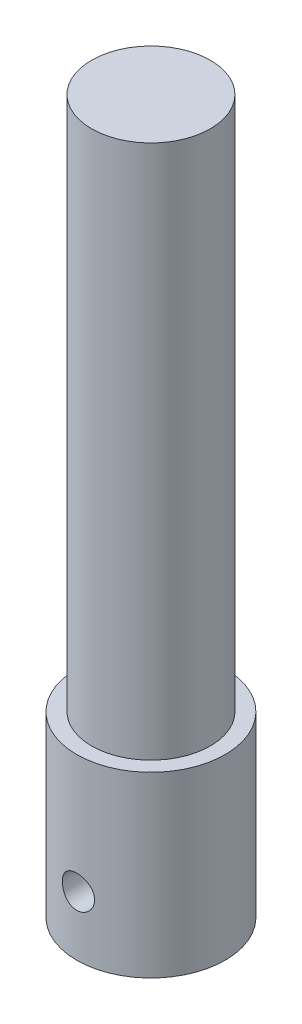
ISO-10303-21;
HEADER;
FILE_DESCRIPTION(('STEP AP214'),'2;1');
FILE_NAME('part.step','',(''),(''),'','','');
FILE_SCHEMA(('AUTOMOTIVE_DESIGN { 1 0 10303 214 1 1 1 1 }'));
ENDSEC;
DATA;
#1=APPLICATION_CONTEXT('core data for automotive mechanical design processes');
#2=APPLICATION_PROTOCOL_DEFINITION('international standard','automotive_design',2000,#1);
#3=PRODUCT_CONTEXT('',#1,'mechanical');
#4=PRODUCT('Part','Part','',(#3));
#5=PRODUCT_RELATED_PRODUCT_CATEGORY('part','',(#4));
#6=PRODUCT_DEFINITION_FORMATION('','',#4);
#7=PRODUCT_DEFINITION_CONTEXT('part definition',#1,'design');
#8=PRODUCT_DEFINITION('design','',#6,#7);
#9=PRODUCT_DEFINITION_SHAPE('','',#8);
#10=(LENGTH_UNIT() NAMED_UNIT(*) SI_UNIT(.MILLI.,.METRE.));
#11=(NAMED_UNIT(*) PLANE_ANGLE_UNIT() SI_UNIT($,.RADIAN.));
#12=(NAMED_UNIT(*) SI_UNIT($,.STERADIAN.) SOLID_ANGLE_UNIT());
#13=UNCERTAINTY_MEASURE_WITH_UNIT(LENGTH_MEASURE(1.E-05),#10,'distance_accuracy_value','');
#14=(GEOMETRIC_REPRESENTATION_CONTEXT(3) GLOBAL_UNCERTAINTY_ASSIGNED_CONTEXT((#13)) GLOBAL_UNIT_ASSIGNED_CONTEXT((#10,
#11,#12)) REPRESENTATION_CONTEXT('',''));
#15=CARTESIAN_POINT('',(0.,0.,0.));
#16=DIRECTION('',(0.,0.,1.));
#17=DIRECTION('',(1.,0.,0.));
#18=AXIS2_PLACEMENT_3D('',#15,#16,#17);
#19=CARTESIAN_POINT('',(0.,76.2,0.));
#20=DIRECTION('',(0.,-1.,0.));
#21=DIRECTION('',(0.,0.,-1.));
#22=AXIS2_PLACEMENT_3D('',#19,#20,#21);
#23=CYLINDRICAL_SURFACE('',#22,7.9375);
#24=CARTESIAN_POINT('',(0.,0.,0.));
#25=DIRECTION('',(0.,1.,0.));
#26=DIRECTION('',(0.,0.,1.));
#27=AXIS2_PLACEMENT_3D('',#24,#25,#26);
#28=CIRCLE('',#27,7.9375);
#29=CARTESIAN_POINT('',(0.,0.,7.9375));
#30=VERTEX_POINT('',#29);
#31=EDGE_CURVE('E62',#30,#30,#28,.T.);
#32=ORIENTED_EDGE('',*,*,#31,.T.);
#33=EDGE_LOOP('',(#32));
#34=FACE_BOUND('',#33,.T.);
#35=CARTESIAN_POINT('',(1.72719999999999,6.35,7.7473018793642));
#36=CARTESIAN_POINT('',(1.72719668934658,6.25422288416648,7.74730381496256));
#37=CARTESIAN_POINT('',(1.71920632372826,6.15840585932472,7.74909730894188));
#38=CARTESIAN_POINT('',(1.68749044022202,5.96949577976598,7.75606448138887));
#39=CARTESIAN_POINT('',(1.66375347043684,5.87640475905212,7.76124061988249));
#40=CARTESIAN_POINT('',(1.60132643913847,5.69570670160267,7.77435972900402));
#41=CARTESIAN_POINT('',(1.56265268844324,5.60809380364676,7.7822996806445));
#42=CARTESIAN_POINT('',(1.47149645243334,5.44059812370354,7.80004815248563));
#43=CARTESIAN_POINT('',(1.41901428176313,5.36071516563528,7.80985663010786));
#44=CARTESIAN_POINT('',(1.3007955986685,5.20960983626217,7.83042021280774));
#45=CARTESIAN_POINT('',(1.23487188523277,5.13853553146913,7.84118732124447));
#46=CARTESIAN_POINT('',(1.09204558542811,5.00836156326581,7.86234986267427));
#47=CARTESIAN_POINT('',(1.01514215186849,4.94926282473741,7.87274526690934));
#48=CARTESIAN_POINT('',(0.851547461158121,4.84413258948296,7.8921237586244));
#49=CARTESIAN_POINT('',(0.764762720819407,4.79824339763196,7.90109103211215));
#50=CARTESIAN_POINT('',(0.584485850349367,4.7217553989361,7.91646735399278));
#51=CARTESIAN_POINT('',(0.490994466326205,4.69115489424581,7.92287668643523));
#52=CARTESIAN_POINT('',(0.301497545745398,4.64657829765895,7.93233014656776));
#53=CARTESIAN_POINT('',(0.2055535200886,4.63235164682827,7.93542494201542));
#54=CARTESIAN_POINT('',(0.0125939937887284,4.62014331000262,7.93807614197008));
#55=CARTESIAN_POINT('',(-0.0844213842408734,4.62215978387743,7.9376329472844));
#56=CARTESIAN_POINT('',(-0.275042770208705,4.6421936310245,7.93329685945403));
#57=CARTESIAN_POINT('',(-0.368678680066907,4.65994094421362,7.92946219205056));
#58=CARTESIAN_POINT('',(-0.551610549776873,4.71050246465257,7.91884032698867));
#59=CARTESIAN_POINT('',(-0.640906314528686,4.74331734853447,7.91205299673719));
#60=CARTESIAN_POINT('',(-0.813374094986065,4.82332210117314,7.89619466058037));
#61=CARTESIAN_POINT('',(-0.896496972790562,4.8706145519973,7.88710744090932));
#62=CARTESIAN_POINT('',(-1.05372538980822,4.97815552091432,7.86764605576621));
#63=CARTESIAN_POINT('',(-1.12782971028207,5.0384057870478,7.85727171673861));
#64=CARTESIAN_POINT('',(-1.26652341474835,5.17162307560381,7.83612500001915));
#65=CARTESIAN_POINT('',(-1.33088539251444,5.24482645600858,7.82534882507236));
#66=CARTESIAN_POINT('',(-1.44646167392768,5.401098902571,7.80481330708035));
#67=CARTESIAN_POINT('',(-1.49767562855542,5.48416823053848,7.79505399103213));
#68=CARTESIAN_POINT('',(-1.58560173217603,5.65817964344237,7.77764730936367));
#69=CARTESIAN_POINT('',(-1.622271288776,5.749143913918,7.7700061660739));
#70=CARTESIAN_POINT('',(-1.67973550197491,5.93614897813458,7.75778750126867));
#71=CARTESIAN_POINT('',(-1.70053264822222,6.03218897320073,7.75320949930164));
#72=CARTESIAN_POINT('',(-1.72530975432462,6.22454240854874,7.74773333755294));
#73=CARTESIAN_POINT('',(-1.72962066551708,6.32081120717702,7.74676277197584));
#74=CARTESIAN_POINT('',(-1.72219860348343,6.51269195501178,7.74841611592597));
#75=CARTESIAN_POINT('',(-1.7104667202093,6.60830394839825,7.75103978126017));
#76=CARTESIAN_POINT('',(-1.67157912238781,6.79500713602921,7.75951762781856));
#77=CARTESIAN_POINT('',(-1.64460535153474,6.8861381176756,7.76533367824959));
#78=CARTESIAN_POINT('',(-1.57619651373566,7.06258711434735,7.77950663468477));
#79=CARTESIAN_POINT('',(-1.53476007433112,7.1479045767706,7.78786378182073));
#80=CARTESIAN_POINT('',(-1.43787173536774,7.31173787737346,7.80633659541367));
#81=CARTESIAN_POINT('',(-1.382215763733,7.39013016914734,7.81647713253223));
#82=CARTESIAN_POINT('',(-1.25873556642946,7.53658387451228,7.83730838639294));
#83=CARTESIAN_POINT('',(-1.19090984594748,7.60464401710499,7.84799917060691));
#84=CARTESIAN_POINT('',(-1.04351860870932,7.72978417303057,7.86896478339164));
#85=CARTESIAN_POINT('',(-0.963759740693738,7.78663866868895,7.87922831243881));
#86=CARTESIAN_POINT('',(-0.795631059762875,7.88614174220978,7.8979757812757));
#87=CARTESIAN_POINT('',(-0.707261646997062,7.92879097981278,7.906459803705));
#88=CARTESIAN_POINT('',(-0.524967980829005,7.99835790325755,7.92064465625516));
#89=CARTESIAN_POINT('',(-0.431082954098463,8.02537465147462,7.9263629737321));
#90=CARTESIAN_POINT('',(-0.239968524092139,8.06321934522901,7.9344476901939));
#91=CARTESIAN_POINT('',(-0.142739603787827,8.07404961867933,7.93681457117443));
#92=CARTESIAN_POINT('',(0.0501609432954705,8.07911016664185,7.93791560193408));
#93=CARTESIAN_POINT('',(0.145823467958653,8.07367729191246,7.93672346923526));
#94=CARTESIAN_POINT('',(0.334837197040776,8.04711862207229,7.93099817961568));
#95=CARTESIAN_POINT('',(0.428188442148943,8.025993103428,7.92646508155467));
#96=CARTESIAN_POINT('',(0.609672330433966,7.96880953945719,7.91457244917229));
#97=CARTESIAN_POINT('',(0.69782050928875,7.93279881721793,7.90722187750907));
#98=CARTESIAN_POINT('',(0.866868651522248,7.84691337558385,7.89047962727249));
#99=CARTESIAN_POINT('',(0.947767918166765,7.79703732539953,7.88108775279446));
#100=CARTESIAN_POINT('',(1.10166630982573,7.68373628494776,7.86106733244498));
#101=CARTESIAN_POINT('',(1.17448827291634,7.62007415348513,7.85041885288323));
#102=CARTESIAN_POINT('',(1.30853075097088,7.48148698201705,7.82919343609071));
#103=CARTESIAN_POINT('',(1.36974846889949,7.40655923438225,7.8186165166994));
#104=CARTESIAN_POINT('',(1.47962273760144,7.24637822799069,7.79857623674616));
#105=CARTESIAN_POINT('',(1.52810277350503,7.1610017038244,7.78912942210013));
#106=CARTESIAN_POINT('',(1.60994979803619,6.98312621324617,7.77262661741541));
#107=CARTESIAN_POINT('',(1.64332963527668,6.89063338075126,7.7655685960685));
#108=CARTESIAN_POINT('',(1.68803709150407,6.72336573508989,7.75595396623194));
#109=CARTESIAN_POINT('',(1.70269513711225,6.64950133007811,7.7527308775046));
#110=CARTESIAN_POINT('',(1.72227765922195,6.50043278112664,7.74840412449431));
#111=CARTESIAN_POINT('',(1.72720260037227,6.42522870131466,7.74730035903703));
#112=CARTESIAN_POINT('',(1.72719999999999,6.35,7.7473018793642));
#113=B_SPLINE_CURVE_WITH_KNOTS('',3,(#35,#36,#37,#38,#39,#40,#41,#42,#43,#44,#45,#46,#47,#48,
#49,#50,#51,#52,#53,#54,#55,#56,#57,#58,#59,#60,#61,#62,#63,#64,#65,#66,#67,#68,#69,#70,#71,#72,
#73,#74,#75,#76,#77,#78,#79,#80,#81,#82,#83,#84,#85,#86,#87,#88,#89,#90,#91,#92,#93,#94,#95,#96,
#97,#98,#99,#100,#101,#102,#103,#104,#105,#106,#107,#108,#109,#110,#111,#112),.UNSPECIFIED.,.T.,
.F.,(4,2,2,2,2,2,2,2,2,2,2,2,2,2,2,2,2,2,2,2,2,2,2,2,2,2,2,2,2,2,2,2,2,2,2,2,2,2,4),(0.,
0.28705565618224,0.574320306064567,0.86127214865707,1.14821745321058,1.43947171295688,
1.73074845791978,2.02505475487072,2.31932836113179,2.60903636539003,2.89871155004214,
3.18350800798754,3.46831725639996,3.75519318042258,4.04210782900355,4.33493181497964,
4.62776357327903,4.92144664994573,5.21508365182388,5.50279414401125,5.79048509003796,
6.07481227147667,6.35916644194667,6.64785640854874,6.93658185931359,7.23062929606426,
7.52466307434604,7.81681257042761,8.10892004598983,8.3950193890394,8.68111369182897,
8.96630535414906,9.25152439852483,9.54210676580753,9.83275908494857,10.1272488529481,
10.4214875689436,10.6469678939814,10.8724374545511),.UNSPECIFIED.);
#114=CARTESIAN_POINT('',(1.72719999999999,6.35,7.7473018793642));
#115=VERTEX_POINT('',#114);
#116=EDGE_CURVE('E49',#115,#115,#113,.T.);
#117=ORIENTED_EDGE('',*,*,#116,.T.);
#118=EDGE_LOOP('',(#117));
#119=FACE_BOUND('',#118,.T.);
#120=CARTESIAN_POINT('',(0.,8.0772,-7.9375));
#121=CARTESIAN_POINT('',(-0.0958073881689638,8.07719671111839,-7.93749823123906));
#122=CARTESIAN_POINT('',(-0.191654631127748,8.06920146534662,-7.93574773763832));
#123=CARTESIAN_POINT('',(-0.380627437848209,8.03746444271959,-7.92893373607812));
#124=CARTESIAN_POINT('',(-0.473750992784543,8.0137113350977,-7.9238678442009));
#125=CARTESIAN_POINT('',(-0.654517984196971,7.95123713123429,-7.91098719512658));
#126=CARTESIAN_POINT('',(-0.742167005950519,7.91253158954596,-7.90317529527452));
#127=CARTESIAN_POINT('',(-0.909723685589415,7.8213003937817,-7.88564613455322));
#128=CARTESIAN_POINT('',(-0.989631559862098,7.76877512615946,-7.8759289269658));
#129=CARTESIAN_POINT('',(-1.14071073132593,7.6505120795031,-7.8554813122122));
#130=CARTESIAN_POINT('',(-1.21174139937616,7.58459678742661,-7.84473844639552));
#131=CARTESIAN_POINT('',(-1.34183058450904,7.44180590413595,-7.82353826576888));
#132=CARTESIAN_POINT('',(-1.40088804281956,7.36492934465704,-7.81308097628268));
#133=CARTESIAN_POINT('',(-1.5059734850126,7.20136015333899,-7.7935131946505));
#134=CARTESIAN_POINT('',(-1.55185201420408,7.11456942312731,-7.78441867087501));
#135=CARTESIAN_POINT('',(-1.62831867237903,6.93427962880297,-7.76878483890528));
#136=CARTESIAN_POINT('',(-1.65890860943664,6.84078135944,-7.76224522857938));
#137=CARTESIAN_POINT('',(-1.70346549614082,6.65125527167878,-7.75258849074546));
#138=CARTESIAN_POINT('',(-1.71768129241551,6.55528861941545,-7.74942018588863));
#139=CARTESIAN_POINT('',(-1.72986006814801,6.36228419083473,-7.74671106045341));
#140=CARTESIAN_POINT('',(-1.7278250240853,6.26524654620843,-7.7471697987423));
#141=CARTESIAN_POINT('',(-1.70776020281197,6.0747028226476,-7.75161658533985));
#142=CARTESIAN_POINT('',(-1.69001926793959,5.98116461509589,-7.75554089613588));
#143=CARTESIAN_POINT('',(-1.6395037736733,5.79842478330104,-7.76637590985054));
#144=CARTESIAN_POINT('',(-1.60672837861298,5.70922340041822,-7.77328677877099));
#145=CARTESIAN_POINT('',(-1.52680845692337,5.53687604108789,-7.78937918391718));
#146=CARTESIAN_POINT('',(-1.47955265268967,5.45378336540575,-7.79857819698602));
#147=CARTESIAN_POINT('',(-1.37209159269284,5.29660014449477,-7.81819964287656));
#148=CARTESIAN_POINT('',(-1.31188458893718,5.22251081654074,-7.82862224075623));
#149=CARTESIAN_POINT('',(-1.17870011171346,5.08377422713114,-7.84979012929631));
#150=CARTESIAN_POINT('',(-1.10547696900433,5.01936289842318,-7.86053755301087));
#151=CARTESIAN_POINT('',(-0.949146705657905,4.90369617395151,-7.88094098483665));
#152=CARTESIAN_POINT('',(-0.866039409571111,4.85244101176847,-7.89059697356832));
#153=CARTESIAN_POINT('',(-0.692013590533541,4.76448418494795,-7.90776040439147));
#154=CARTESIAN_POINT('',(-0.601079090866837,4.72781318924851,-7.91526330965628));
#155=CARTESIAN_POINT('',(-0.414139308890587,4.67033718338767,-7.92724143566355));
#156=CARTESIAN_POINT('',(-0.318134758336938,4.64952989028775,-7.93171709204561));
#157=CARTESIAN_POINT('',(-0.12580408459721,4.62471452342532,-7.93707451121609));
#158=CARTESIAN_POINT('',(-0.0295214146921431,4.62038412610351,-7.93802521998525));
#159=CARTESIAN_POINT('',(0.162391579388402,4.62777218110166,-7.93641872364663));
#160=CARTESIAN_POINT('',(0.258021946898738,4.63948955666463,-7.93386175389344));
#161=CARTESIAN_POINT('',(0.444849540530789,4.67837323930876,-7.92557069335395));
#162=CARTESIAN_POINT('',(0.536083582859785,4.70537071603468,-7.91987134035831));
#163=CARTESIAN_POINT('',(0.712728334819346,4.77386102862357,-7.90593334051042));
#164=CARTESIAN_POINT('',(0.798138551128837,4.81535509063581,-7.89769447886854));
#165=CARTESIAN_POINT('',(0.962045634312511,4.91233389045406,-7.87942116984806));
#166=CARTESIAN_POINT('',(1.04042758538542,4.96800827572241,-7.86936296606736));
#167=CARTESIAN_POINT('',(1.18685200214202,5.09151733516522,-7.84861561400828));
#168=CARTESIAN_POINT('',(1.25489313766936,5.15935357129679,-7.83792638480515));
#169=CARTESIAN_POINT('',(1.37997692566292,5.30673906849459,-7.81688394304775));
#170=CARTESIAN_POINT('',(1.43679650032909,5.38647928852886,-7.8065404064753));
#171=CARTESIAN_POINT('',(1.53623833452736,5.55455987311723,-7.78758313020685));
#172=CARTESIAN_POINT('',(1.57886120614655,5.6428998666821,-7.7789693159407));
#173=CARTESIAN_POINT('',(1.64841342423577,5.82519991591713,-7.76452846939796));
#174=CARTESIAN_POINT('',(1.67543065695436,5.91912514637512,-7.75868586450804));
#175=CARTESIAN_POINT('',(1.71326275790443,6.11032560029862,-7.75042055627495));
#176=CARTESIAN_POINT('',(1.72408018644346,6.20760029191002,-7.74799731252034));
#177=CARTESIAN_POINT('',(1.72909752111868,6.40048977631736,-7.74687889875348));
#178=CARTESIAN_POINT('',(1.72365104863841,6.49609508094238,-7.74810439354014));
#179=CARTESIAN_POINT('',(1.69708510466239,6.68499070092299,-7.75396608736977));
#180=CARTESIAN_POINT('',(1.67596581393623,6.77828104296644,-7.75860224707428));
#181=CARTESIAN_POINT('',(1.61882377936269,6.9596211621887,-7.77072441574352));
#182=CARTESIAN_POINT('',(1.58285199436584,7.04768769200509,-7.77820067339822));
#183=CARTESIAN_POINT('',(1.49707004335149,7.21658837125174,-7.79516457788436));
#184=CARTESIAN_POINT('',(1.4472584527227,7.29742177500142,-7.80465243175721));
#185=CARTESIAN_POINT('',(1.33403578133058,7.45130595668544,-7.82480783773573));
#186=CARTESIAN_POINT('',(1.27037247419318,7.5241685957188,-7.83549519977694));
#187=CARTESIAN_POINT('',(1.13176529220538,7.65829258457816,-7.85671175612166));
#188=CARTESIAN_POINT('',(1.05681881453685,7.7195512502004,-7.86724091331228));
#189=CARTESIAN_POINT('',(0.896615921921774,7.82947904768777,-7.8871146306621));
#190=CARTESIAN_POINT('',(0.81123973085156,7.87797684814172,-7.89644228760264));
#191=CARTESIAN_POINT('',(0.63336299799249,7.95985717202353,-7.91269266690878));
#192=CARTESIAN_POINT('',(0.540868536319347,7.99325243132619,-7.91961741448108));
#193=CARTESIAN_POINT('',(0.373561939374604,8.03799563726985,-7.92903932251991));
#194=CARTESIAN_POINT('',(0.299658034136913,8.05266933824683,-7.93219249260771));
#195=CARTESIAN_POINT('',(0.150510913052046,8.07227259980638,-7.93642348104108));
#196=CARTESIAN_POINT('',(0.0752677555445903,8.07720258379591,-7.93750138956576));
#197=CARTESIAN_POINT('',(0.,8.0772,-7.9375));
#198=B_SPLINE_CURVE_WITH_KNOTS('',3,(#120,#121,#122,#123,#124,#125,#126,#127,#128,#129,#130,
#131,#132,#133,#134,#135,#136,#137,#138,#139,#140,#141,#142,#143,#144,#145,#146,#147,#148,#149,
#150,#151,#152,#153,#154,#155,#156,#157,#158,#159,#160,#161,#162,#163,#164,#165,#166,#167,#168,
#169,#170,#171,#172,#173,#174,#175,#176,#177,#178,#179,#180,#181,#182,#183,#184,#185,#186,#187,
#188,#189,#190,#191,#192,#193,#194,#195,#196,#197),.UNSPECIFIED.,.T.,.F.,(4,2,2,2,2,2,2,2,2,2,2,
2,2,2,2,2,2,2,2,2,2,2,2,2,2,2,2,2,2,2,2,2,2,2,2,2,2,2,4),(0.,0.287146664144717,
0.574500026604635,0.861555265748942,1.14860247855707,1.43973768043966,1.73089861573248,
2.02524168065781,2.31954992745942,2.60932381276328,2.89906245537193,3.18358079335431,
3.4681149477496,3.75489295700923,4.04170969632578,4.33466300802739,4.62762152059773,
4.92119287668269,5.21472197706305,5.50247858255765,5.79021588140075,6.07483434466125,
6.3594768873336,6.64814684314179,6.936853899677,7.23082329647932,7.52478001722772,
7.81706470306555,8.10930318972203,8.39523421285745,8.68116193812873,8.96611669259419,
9.25110078997556,9.54178852762672,9.83254342458674,10.1270230391282,10.4212538557239,
10.6468504884146,10.8724373177327),.UNSPECIFIED.);
#199=CARTESIAN_POINT('',(0.,8.0772,-7.9375));
#200=VERTEX_POINT('',#199);
#201=EDGE_CURVE('E12',#200,#200,#198,.T.);
#202=ORIENTED_EDGE('',*,*,#201,.T.);
#203=EDGE_LOOP('',(#202));
#204=FACE_BOUND('',#203,.T.);
#205=CARTESIAN_POINT('',(0.,19.05,0.));
#206=DIRECTION('',(0.,1.,0.));
#207=DIRECTION('',(0.,0.,1.));
#208=AXIS2_PLACEMENT_3D('',#205,#206,#207);
#209=CIRCLE('',#208,7.9375);
#210=CARTESIAN_POINT('',(0.,19.05,7.9375));
#211=VERTEX_POINT('',#210);
#212=EDGE_CURVE('E133',#211,#211,#209,.F.);
#213=ORIENTED_EDGE('',*,*,#212,.T.);
#214=EDGE_LOOP('',(#213));
#215=FACE_BOUND('',#214,.T.);
#216=ADVANCED_FACE('F39',(#34,#119,#204,#215),#23,.T.);
#217=CARTESIAN_POINT('',(0.,0.,0.));
#218=DIRECTION('',(0.,1.,0.));
#219=DIRECTION('',(0.,0.,1.));
#220=AXIS2_PLACEMENT_3D('',#217,#218,#219);
#221=PLANE('',#220);
#222=CARTESIAN_POINT('',(0.,0.,0.));
#223=DIRECTION('',(0.,-1.,0.));
#224=DIRECTION('',(0.,0.,-1.));
#225=AXIS2_PLACEMENT_3D('',#222,#223,#224);
#226=CIRCLE('',#225,5.);
#227=CARTESIAN_POINT('',(0.,0.,-5.));
#228=VERTEX_POINT('',#227);
#229=EDGE_CURVE('E102',#228,#228,#226,.T.);
#230=ORIENTED_EDGE('',*,*,#229,.F.);
#231=EDGE_LOOP('',(#230));
#232=FACE_BOUND('',#231,.T.);
#233=ORIENTED_EDGE('',*,*,#31,.F.);
#234=EDGE_LOOP('',(#233));
#235=FACE_BOUND('',#234,.T.);
#236=ADVANCED_FACE('F117',(#232,#235),#221,.F.);
#237=CARTESIAN_POINT('',(0.,13.9999974,0.));
#238=DIRECTION('',(0.,-1.,0.));
#239=DIRECTION('',(0.,0.,-1.));
#240=AXIS2_PLACEMENT_3D('',#237,#238,#239);
#241=CONICAL_SURFACE('',#240,4.99999999999999,1.02974425867665);
#242=CARTESIAN_POINT('',(0.,13.9999974,0.));
#243=DIRECTION('',(0.,-1.,0.));
#244=DIRECTION('',(0.,0.,-1.));
#245=AXIS2_PLACEMENT_3D('',#242,#243,#244);
#246=CIRCLE('',#245,4.99999999999999);
#247=CARTESIAN_POINT('',(0.,13.9999974,-4.99999999999999));
#248=VERTEX_POINT('',#247);
#249=EDGE_CURVE('E68',#248,#248,#246,.T.);
#250=ORIENTED_EDGE('',*,*,#249,.T.);
#251=EDGE_LOOP('',(#250));
#252=FACE_BOUND('',#251,.T.);
#253=CARTESIAN_POINT('',(0.,15.5021489475689,0.));
#254=DIRECTION('',(0.,-1.,0.));
#255=DIRECTION('',(0.,0.,-1.));
#256=AXIS2_PLACEMENT_3D('',#253,#254,#255);
#257=CIRCLE('',#256,2.49999999999999);
#258=CARTESIAN_POINT('',(0.,15.5021489475689,-2.49999999999999));
#259=VERTEX_POINT('',#258);
#260=EDGE_CURVE('E63',#259,#259,#257,.T.);
#261=ORIENTED_EDGE('',*,*,#260,.F.);
#262=EDGE_LOOP('',(#261));
#263=FACE_BOUND('',#262,.T.);
#264=ADVANCED_FACE('F109',(#252,#263),#241,.F.);
#265=CARTESIAN_POINT('',(0.,0.,0.));
#266=DIRECTION('',(0.,-1.,0.));
#267=DIRECTION('',(0.,0.,-1.));
#268=AXIS2_PLACEMENT_3D('',#265,#266,#267);
#269=CYLINDRICAL_SURFACE('',#268,5.);
#270=CARTESIAN_POINT('',(0.,8.07719999999999,-5.));
#271=CARTESIAN_POINT('',(0.0940449408651366,8.07720116265513,-5.00000079942631));
#272=CARTESIAN_POINT('',(0.188081633757626,8.06949422088853,-4.99732257027515));
#273=CARTESIAN_POINT('',(0.373373503491975,8.03897280828679,-4.98690339520418));
#274=CARTESIAN_POINT('',(0.464628592088385,8.01615785867594,-4.97916228884091));
#275=CARTESIAN_POINT('',(0.641659270119769,7.9563039881358,-4.9594556814055));
#276=CARTESIAN_POINT('',(0.727444118926599,7.91928988966881,-4.94749755531022));
#277=CARTESIAN_POINT('',(0.891586747816597,7.83220456628972,-4.92056907688888));
#278=CARTESIAN_POINT('',(0.969942894157221,7.78213047822613,-4.90559806420996));
#279=CARTESIAN_POINT('',(1.11989268103054,7.66841057743112,-4.87359381918457));
#280=CARTESIAN_POINT('',(1.19117501380561,7.60436901304805,-4.85650858485669));
#281=CARTESIAN_POINT('',(1.32222952034659,7.46537295796562,-4.82247884422));
#282=CARTESIAN_POINT('',(1.38199890175022,7.3904158275161,-4.80553437300318));
#283=CARTESIAN_POINT('',(1.49016341010503,7.22884750085283,-4.77312352937626));
#284=CARTESIAN_POINT('',(1.53814414194398,7.1419450475213,-4.75771999247715));
#285=CARTESIAN_POINT('',(1.61867451929712,6.96068651688071,-4.73093090977148));
#286=CARTESIAN_POINT('',(1.65122927403153,6.86633291955297,-4.71954403393101));
#287=CARTESIAN_POINT('',(1.69879843436544,6.67640461786643,-4.70262741009603));
#288=CARTESIAN_POINT('',(1.71439944070872,6.58099475570374,-4.69690244492562));
#289=CARTESIAN_POINT('',(1.72945240274194,6.38875298738494,-4.69138198174932));
#290=CARTESIAN_POINT('',(1.72890979400622,6.29192157084345,-4.69158448795642));
#291=CARTESIAN_POINT('',(1.71214441090524,6.10468521120833,-4.69772577339025));
#292=CARTESIAN_POINT('',(1.69669996236303,6.01419958543215,-4.70337980794807));
#293=CARTESIAN_POINT('',(1.65184376421996,5.83719316035008,-4.71931911173755));
#294=CARTESIAN_POINT('',(1.62243022563206,5.75067287043162,-4.7296049741473));
#295=CARTESIAN_POINT('',(1.54998492009236,5.58233628408278,-4.75384283066068));
#296=CARTESIAN_POINT('',(1.50673073788483,5.5006246001474,-4.76785402023326));
#297=CARTESIAN_POINT('',(1.40798645799129,5.34537889733085,-4.79794044050458));
#298=CARTESIAN_POINT('',(1.35249262100385,5.27184738790126,-4.81401630134678));
#299=CARTESIAN_POINT('',(1.22715574881176,5.13069312065037,-4.84752736185009));
#300=CARTESIAN_POINT('',(1.15668044441156,5.06363663664367,-4.86498811964578));
#301=CARTESIAN_POINT('',(1.00527289174511,4.94214044526146,-4.89851318729995));
#302=CARTESIAN_POINT('',(0.92433948811894,4.88770213373943,-4.91457734254007));
#303=CARTESIAN_POINT('',(0.753044652855833,4.79248613062528,-4.94373808959486));
#304=CARTESIAN_POINT('',(0.662586695592304,4.7518703891863,-4.95679895491661));
#305=CARTESIAN_POINT('',(0.475561641213947,4.68661190734717,-4.97822084267994));
#306=CARTESIAN_POINT('',(0.378996845156973,4.66196318946855,-4.98658362375919));
#307=CARTESIAN_POINT('',(0.187285379605818,4.63036536519869,-4.99737073920977));
#308=CARTESIAN_POINT('',(0.0922789619214777,4.62265185230013,-5.00005134404294));
#309=CARTESIAN_POINT('',(-0.0976960468979297,4.62295239495948,-4.99994718881525));
#310=CARTESIAN_POINT('',(-0.192664641773858,4.63096357122274,-4.99716342931566));
#311=CARTESIAN_POINT('',(-0.376740936268978,4.6618872901274,-4.98661267482041));
#312=CARTESIAN_POINT('',(-0.465939016406978,4.68432186767275,-4.97900562252394));
#313=CARTESIAN_POINT('',(-0.639262253029315,4.74284915498502,-4.95973323895622));
#314=CARTESIAN_POINT('',(-0.723386753490176,4.77894362663125,-4.94806738418852));
#315=CARTESIAN_POINT('',(-0.886739982136149,4.86485325110824,-4.92145627061905));
#316=CARTESIAN_POINT('',(-0.965772202783828,4.91501627057812,-4.9064301351535));
#317=CARTESIAN_POINT('',(-1.11454073658625,5.02723511181915,-4.87479157181482));
#318=CARTESIAN_POINT('',(-1.18427401741103,5.08929479702085,-4.85817862950949));
#319=CARTESIAN_POINT('',(-1.31602449564797,5.22713493326521,-4.82420322673878));
#320=CARTESIAN_POINT('',(-1.377496584157,5.30343848183104,-4.80684390288432));
#321=CARTESIAN_POINT('',(-1.486842496761,5.46564438129977,-4.7741561300039));
#322=CARTESIAN_POINT('',(-1.53471595299881,5.55154699177969,-4.7588277359227));
#323=CARTESIAN_POINT('',(-1.61534487579355,5.73070968032251,-4.7320687845667));
#324=CARTESIAN_POINT('',(-1.64810930767807,5.82396535668357,-4.72063591683575));
#325=CARTESIAN_POINT('',(-1.6973022646142,6.01516253766475,-4.70317548824141));
#326=CARTESIAN_POINT('',(-1.71373888203928,6.11310169580934,-4.69714524987834));
#327=CARTESIAN_POINT('',(-1.7291506594103,6.3050823298651,-4.69149214728555));
#328=CARTESIAN_POINT('',(-1.72903732450297,6.39904154054942,-4.69153480859927));
#329=CARTESIAN_POINT('',(-1.71362161859673,6.58552613452239,-4.69718711729162));
#330=CARTESIAN_POINT('',(-1.69832028453149,6.67805161525842,-4.7027963846201));
#331=CARTESIAN_POINT('',(-1.65362765066886,6.85701025652032,-4.71869212724641));
#332=CARTESIAN_POINT('',(-1.62455270423533,6.94353252404445,-4.7288733331959));
#333=CARTESIAN_POINT('',(-1.55340003692141,7.11053384698558,-4.75272022361515));
#334=CARTESIAN_POINT('',(-1.51131930191303,7.19101149616567,-4.76638671568124));
#335=CARTESIAN_POINT('',(-1.41308226799206,7.34767615682291,-4.79645178235935));
#336=CARTESIAN_POINT('',(-1.35636506504393,7.42349266885566,-4.81294747113999));
#337=CARTESIAN_POINT('',(-1.23139041182781,7.56482569938245,-4.84642733206836));
#338=CARTESIAN_POINT('',(-1.16312958590353,7.63033919415915,-4.86341164589365));
#339=CARTESIAN_POINT('',(-1.01348345454366,7.75205733793863,-4.89683246969787));
#340=CARTESIAN_POINT('',(-0.931659862448797,7.80774026652863,-4.9132139790377));
#341=CARTESIAN_POINT('',(-0.759262281947612,7.9045116590769,-4.94278837014072));
#342=CARTESIAN_POINT('',(-0.668689761684898,7.94560256630571,-4.95598178559619));
#343=CARTESIAN_POINT('',(-0.483218412220674,8.01108149736962,-4.97745223766152));
#344=CARTESIAN_POINT('',(-0.38844458278455,8.0357913778655,-4.98582355867447));
#345=CARTESIAN_POINT('',(-0.195776830742899,8.06884732612285,-4.99709612193525));
#346=CARTESIAN_POINT('',(-0.0978839478227571,8.07719878988413,-4.99999916794031));
#347=CARTESIAN_POINT('',(0.,8.07719999999999,-5.));
#348=B_SPLINE_CURVE_WITH_KNOTS('',3,(#270,#271,#272,#273,#274,#275,#276,#277,#278,#279,#280,
#281,#282,#283,#284,#285,#286,#287,#288,#289,#290,#291,#292,#293,#294,#295,#296,#297,#298,#299,
#300,#301,#302,#303,#304,#305,#306,#307,#308,#309,#310,#311,#312,#313,#314,#315,#316,#317,#318,
#319,#320,#321,#322,#323,#324,#325,#326,#327,#328,#329,#330,#331,#332,#333,#334,#335,#336,#337,
#338,#339,#340,#341,#342,#343,#344,#345,#346,#347),.UNSPECIFIED.,.T.,.F.,(4,2,2,2,2,2,2,2,2,2,2,
2,2,2,2,2,2,2,2,2,2,2,2,2,2,2,2,2,2,2,2,2,2,2,2,2,2,2,4),(0.,0.281774370088565,
0.563557670088954,0.844850594695722,1.12620523927717,1.41691085595504,1.70768689211628,
2.00756086094515,2.30733543931669,2.59637060317061,2.88530844964364,3.15992866552218,
3.43458406082507,3.713895667393,3.99329272412942,4.28843044720071,4.58360080357235,
4.88211914868041,5.18052567458974,5.46515944639004,5.74974110472522,6.02534693361676,
6.30098832279813,6.58415924717458,6.86742228729649,7.16455725682958,7.46170026340717,
7.75866672495245,8.05548593076413,8.33596404223696,8.61642300588176,8.89073147362109,
9.16510356084693,9.45216326975532,9.73930706802335,10.0388039213383,10.3382506035883,
10.6316240692266,10.9249007461623),.UNSPECIFIED.);
#349=CARTESIAN_POINT('',(0.,8.07719999999999,-5.));
#350=VERTEX_POINT('',#349);
#351=EDGE_CURVE('E96',#350,#350,#348,.T.);
#352=ORIENTED_EDGE('',*,*,#351,.T.);
#353=EDGE_LOOP('',(#352));
#354=FACE_BOUND('',#353,.T.);
#355=CARTESIAN_POINT('',(1.72719999999999,6.35,4.69220418993036));
#356=CARTESIAN_POINT('',(1.72720119838088,6.44385559289964,4.69220320286375));
#357=CARTESIAN_POINT('',(1.71952410106074,6.53770286548617,4.69505093811544));
#358=CARTESIAN_POINT('',(1.68913201951054,6.72260313312126,4.70606939143049));
#359=CARTESIAN_POINT('',(1.66641545548441,6.81365583356709,4.71424066869514));
#360=CARTESIAN_POINT('',(1.60684882625797,6.99025553982278,4.73487256947088));
#361=CARTESIAN_POINT('',(1.57002813745711,7.07581356045643,4.74732427212033));
#362=CARTESIAN_POINT('',(1.48339995845589,7.2395675789663,4.77510067437078));
#363=CARTESIAN_POINT('',(1.43358928342141,7.31776176499811,4.79042607827537));
#364=CARTESIAN_POINT('',(1.32015103216849,7.46785709307449,4.82294578328765));
#365=CARTESIAN_POINT('',(1.25606832806445,7.53940372696458,4.84018911338318));
#366=CARTESIAN_POINT('',(1.11687482078827,7.67097874847093,4.87418893208168));
#367=CARTESIAN_POINT('',(1.04176209920263,7.73100512821025,4.89094533538658));
#368=CARTESIAN_POINT('',(0.880020870054001,7.83947160537639,4.92265516945796));
#369=CARTESIAN_POINT('',(0.793126934847188,7.88753637977842,4.93754427417919));
#370=CARTESIAN_POINT('',(0.61188364298195,7.9682241689096,4.9632610106259));
#371=CARTESIAN_POINT('',(0.517536463696664,8.00085167412119,4.97408982324227));
#372=CARTESIAN_POINT('',(0.327784695893771,8.04852516600724,4.99011838601907));
#373=CARTESIAN_POINT('',(0.232549610088701,8.06417929360404,4.9955123163201));
#374=CARTESIAN_POINT('',(0.0406618271370156,8.07939949506247,5.00075476274517));
#375=CARTESIAN_POINT('',(-0.0559904707911047,8.07897001572446,5.00060481164331));
#376=CARTESIAN_POINT('',(-0.243649495146016,8.06241214466819,4.99490574068486));
#377=CARTESIAN_POINT('',(-0.334722637551891,8.04694515461474,4.98958409401359));
#378=CARTESIAN_POINT('',(-0.512890680137161,8.00185030405585,4.97442873542385));
#379=CARTESIAN_POINT('',(-0.599985305648804,7.97222146746259,4.96459471249728));
#380=CARTESIAN_POINT('',(-0.769122310600245,7.89928059258357,4.94123921792788));
#381=CARTESIAN_POINT('',(-0.851079767974179,7.8557877650855,4.92766936865848));
#382=CARTESIAN_POINT('',(-1.00672231017782,7.75650528363893,4.89824389396192));
#383=CARTESIAN_POINT('',(-1.08040497021728,7.70071203937833,4.88238760162382));
#384=CARTESIAN_POINT('',(-1.22133204311013,7.5751193594243,4.84910867481679));
#385=CARTESIAN_POINT('',(-1.28806582839256,7.50475635615726,4.83164737194448));
#386=CARTESIAN_POINT('',(-1.40895939359516,7.3537001091237,4.79778952517544));
#387=CARTESIAN_POINT('',(-1.46311692565755,7.27300502261104,4.78139317200263));
#388=CARTESIAN_POINT('',(-1.55809953713171,7.10184804412833,4.75130067923125));
#389=CARTESIAN_POINT('',(-1.59869282566281,7.01124835397995,4.73765292719838));
#390=CARTESIAN_POINT('',(-1.66386767859734,6.82390728532738,4.71516141460625));
#391=CARTESIAN_POINT('',(-1.68845655386724,6.72716873327041,4.70631546087739));
#392=CARTESIAN_POINT('',(-1.71985122537179,6.53527255295242,4.69493118892364));
#393=CARTESIAN_POINT('',(-1.7274544346886,6.44026216494226,4.69211031607577));
#394=CARTESIAN_POINT('',(-1.726932676952,6.25030149412453,4.69230280793576));
#395=CARTESIAN_POINT('',(-1.71881084463344,6.15535120311125,4.69531500983955));
#396=CARTESIAN_POINT('',(-1.68778810967042,5.97195753168534,4.70655101780323));
#397=CARTESIAN_POINT('',(-1.66545806464064,5.88340388531154,4.71457330785574));
#398=CARTESIAN_POINT('',(-1.60734695613841,5.71132390504018,4.73469900824534));
#399=CARTESIAN_POINT('',(-1.57156339936818,5.62779850634302,4.74680317502117));
#400=CARTESIAN_POINT('',(-1.48620414163454,5.4650467848462,4.77422929596816));
#401=CARTESIAN_POINT('',(-1.43620712842341,5.38605772580605,4.78964534244991));
#402=CARTESIAN_POINT('',(-1.32430922046654,5.237303439266,4.82178272440007));
#403=CARTESIAN_POINT('',(-1.262404570263,5.16754113346558,4.83850447067205));
#404=CARTESIAN_POINT('',(-1.12460923037903,5.03544710188322,4.87242633910052));
#405=CARTESIAN_POINT('',(-1.04815655529148,4.97369450723859,4.88960576808912));
#406=CARTESIAN_POINT('',(-0.885549858259207,4.86384870419946,4.92165202625873));
#407=CARTESIAN_POINT('',(-0.799396098221757,4.8157551271659,4.93651891784722));
#408=CARTESIAN_POINT('',(-0.620177615380528,4.73500842187318,4.96220882238412));
#409=CARTESIAN_POINT('',(-0.527157200608564,4.70226486758033,4.97305543718529));
#410=CARTESIAN_POINT('',(-0.336477745970582,4.6530357369685,4.98958149757088));
#411=CARTESIAN_POINT('',(-0.23882053473121,4.6365438063633,4.99526296263016));
#412=CARTESIAN_POINT('',(-0.0469180038327589,4.62089071916228,5.00065506421642));
#413=CARTESIAN_POINT('',(0.0472523962426622,4.62090088157434,5.00065120028324));
#414=CARTESIAN_POINT('',(0.234187468803606,4.63618306329121,4.99538759530472));
#415=CARTESIAN_POINT('',(0.326952269088584,4.65145368653394,4.99012833503514));
#416=CARTESIAN_POINT('',(0.506759815091883,4.69626258193457,4.9750573885511));
#417=CARTESIAN_POINT('',(0.593875756416504,4.72553749963404,4.9653298585398));
#418=CARTESIAN_POINT('',(0.761986561138517,4.79727557834598,4.94232563505398));
#419=CARTESIAN_POINT('',(0.842980290158224,4.83974117603299,4.92904828589525));
#420=CARTESIAN_POINT('',(0.999958780456606,4.93853547887701,4.89966399347397));
#421=CARTESIAN_POINT('',(1.07562972303961,4.99533583534027,4.88346764343634));
#422=CARTESIAN_POINT('',(1.21663317092588,5.1204021446096,4.8502639550523));
#423=CARTESIAN_POINT('',(1.28196224269723,5.18867188984559,4.83325634979532));
#424=CARTESIAN_POINT('',(1.40328708073064,5.33823549982351,4.79947138492356));
#425=CARTESIAN_POINT('',(1.45876223976655,5.41996244352498,4.78273520111549));
#426=CARTESIAN_POINT('',(1.55516659999498,5.59210618629469,4.7522652156286));
#427=CARTESIAN_POINT('',(1.59609823327946,5.6825215291991,4.73853091209783));
#428=CARTESIAN_POINT('',(1.66132194441431,5.86765349623056,4.71605601129578));
#429=CARTESIAN_POINT('',(1.68593958452406,5.96224306093568,4.70721832542581));
#430=CARTESIAN_POINT('',(1.7188745811467,6.15455897589443,4.69529413076168));
#431=CARTESIAN_POINT('',(1.72719875232804,6.25228399736781,4.69220521759637));
#432=CARTESIAN_POINT('',(1.72719999999999,6.35,4.69220418993036));
#433=B_SPLINE_CURVE_WITH_KNOTS('',3,(#355,#356,#357,#358,#359,#360,#361,#362,#363,#364,#365,
#366,#367,#368,#369,#370,#371,#372,#373,#374,#375,#376,#377,#378,#379,#380,#381,#382,#383,#384,
#385,#386,#387,#388,#389,#390,#391,#392,#393,#394,#395,#396,#397,#398,#399,#400,#401,#402,#403,
#404,#405,#406,#407,#408,#409,#410,#411,#412,#413,#414,#415,#416,#417,#418,#419,#420,#421,#422,
#423,#424,#425,#426,#427,#428,#429,#430,#431,#432),.UNSPECIFIED.,.T.,.F.,(4,2,2,2,2,2,2,2,2,2,2,
2,2,2,2,2,2,2,2,2,2,2,2,2,2,2,2,2,2,2,2,2,2,2,2,2,2,2,4),(0.,0.281204353993471,
0.562438251323993,0.843089545507495,1.12380971347577,1.41525361589691,1.7067482683366,
2.00647970267383,2.30612389570743,2.59463596174862,2.88306826047837,3.15936276090373,
3.43567630733341,3.71575153364995,3.99590861832595,4.29016488455384,4.58447370522527,
4.88358137344429,5.18255231226541,5.46716337827761,5.75171771386003,6.02550473111556,
6.29934251350513,6.58234024985181,6.86542738544493,7.16331405101408,7.46119267624677,
7.75729375448996,8.05327901301804,8.3344013464743,8.61549796456652,8.89150470056478,
9.16756245280721,9.45427101151102,9.74107455957646,10.0401815218193,10.3392384412865,
10.6321316448841,10.9249023210482),.UNSPECIFIED.);
#434=CARTESIAN_POINT('',(1.72719999999999,6.35,4.69220418993036));
#435=VERTEX_POINT('',#434);
#436=EDGE_CURVE('E91',#435,#435,#433,.T.);
#437=ORIENTED_EDGE('',*,*,#436,.T.);
#438=EDGE_LOOP('',(#437));
#439=FACE_BOUND('',#438,.T.);
#440=ORIENTED_EDGE('',*,*,#249,.F.);
#441=EDGE_LOOP('',(#440));
#442=FACE_BOUND('',#441,.T.);
#443=ORIENTED_EDGE('',*,*,#229,.T.);
#444=EDGE_LOOP('',(#443));
#445=FACE_BOUND('',#444,.T.);
#446=ADVANCED_FACE('F56',(#354,#439,#442,#445),#269,.F.);
#447=CARTESIAN_POINT('',(0.,29.9999908,0.));
#448=DIRECTION('',(0.,-1.,0.));
#449=DIRECTION('',(0.,0.,-1.));
#450=AXIS2_PLACEMENT_3D('',#447,#448,#449);
#451=CONICAL_SURFACE('',#450,2.49999999999999,1.02974425867665);
#452=CARTESIAN_POINT('',(0.,31.5021423475689,0.));
#453=VERTEX_POINT('',#452);
#454=VERTEX_LOOP('',#453);
#455=FACE_BOUND('',#454,.T.);
#456=CARTESIAN_POINT('',(0.,29.9999908,0.));
#457=DIRECTION('',(0.,-1.,0.));
#458=DIRECTION('',(0.,0.,-1.));
#459=AXIS2_PLACEMENT_3D('',#456,#457,#458);
#460=CIRCLE('',#459,2.49999999999999);
#461=CARTESIAN_POINT('',(0.,29.9999908,-2.49999999999999));
#462=VERTEX_POINT('',#461);
#463=EDGE_CURVE('E60',#462,#462,#460,.T.);
#464=ORIENTED_EDGE('',*,*,#463,.T.);
#465=EDGE_LOOP('',(#464));
#466=FACE_BOUND('',#465,.T.);
#467=ADVANCED_FACE('F52',(#455,#466),#451,.F.);
#468=CARTESIAN_POINT('',(0.,0.,0.));
#469=DIRECTION('',(0.,-1.,0.));
#470=DIRECTION('',(0.,0.,-1.));
#471=AXIS2_PLACEMENT_3D('',#468,#469,#470);
#472=CYLINDRICAL_SURFACE('',#471,2.49999999999999);
#473=ORIENTED_EDGE('',*,*,#260,.T.);
#474=EDGE_LOOP('',(#473));
#475=FACE_BOUND('',#474,.T.);
#476=ORIENTED_EDGE('',*,*,#463,.F.);
#477=EDGE_LOOP('',(#476));
#478=FACE_BOUND('',#477,.T.);
#479=ADVANCED_FACE('F55',(#475,#478),#472,.F.);
#480=CARTESIAN_POINT('',(0.,6.35,7.9375));
#481=DIRECTION('',(0.,0.,1.));
#482=DIRECTION('',(1.,0.,0.));
#483=AXIS2_PLACEMENT_3D('',#480,#481,#482);
#484=CYLINDRICAL_SURFACE('',#483,1.72719999999999);
#485=ORIENTED_EDGE('',*,*,#116,.F.);
#486=EDGE_LOOP('',(#485));
#487=FACE_BOUND('',#486,.T.);
#488=ORIENTED_EDGE('',*,*,#436,.F.);
#489=EDGE_LOOP('',(#488));
#490=FACE_BOUND('',#489,.T.);
#491=ADVANCED_FACE('F81',(#487,#490),#484,.F.);
#492=ORIENTED_EDGE('',*,*,#201,.F.);
#493=EDGE_LOOP('',(#492));
#494=FACE_BOUND('',#493,.T.);
#495=ORIENTED_EDGE('',*,*,#351,.F.);
#496=EDGE_LOOP('',(#495));
#497=FACE_BOUND('',#496,.T.);
#498=ADVANCED_FACE('F75',(#494,#497),#484,.F.);
#499=CARTESIAN_POINT('',(0.,-22.4506403026729,0.));
#500=DIRECTION('',(0.,1.,0.));
#501=DIRECTION('',(0.,0.,1.));
#502=AXIS2_PLACEMENT_3D('',#499,#500,#501);
#503=CYLINDRICAL_SURFACE('',#502,6.35);
#504=CARTESIAN_POINT('',(0.,19.05,0.));
#505=DIRECTION('',(0.,1.,0.));
#506=DIRECTION('',(0.,0.,1.));
#507=AXIS2_PLACEMENT_3D('',#504,#505,#506);
#508=CIRCLE('',#507,6.35);
#509=CARTESIAN_POINT('',(0.,19.05,6.35));
#510=VERTEX_POINT('',#509);
#511=EDGE_CURVE('E97',#510,#510,#508,.F.);
#512=ORIENTED_EDGE('',*,*,#511,.F.);
#513=EDGE_LOOP('',(#512));
#514=FACE_BOUND('',#513,.T.);
#515=CARTESIAN_POINT('',(0.,76.2,0.));
#516=DIRECTION('',(0.,1.,0.));
#517=DIRECTION('',(0.,0.,1.));
#518=AXIS2_PLACEMENT_3D('',#515,#516,#517);
#519=CIRCLE('',#518,6.35);
#520=CARTESIAN_POINT('',(0.,76.2,6.35));
#521=VERTEX_POINT('',#520);
#522=EDGE_CURVE('E135',#521,#521,#519,.T.);
#523=ORIENTED_EDGE('',*,*,#522,.F.);
#524=EDGE_LOOP('',(#523));
#525=FACE_BOUND('',#524,.T.);
#526=ADVANCED_FACE('F80',(#514,#525),#503,.T.);
#527=CARTESIAN_POINT('',(0.,19.05,0.));
#528=DIRECTION('',(0.,1.,0.));
#529=DIRECTION('',(0.,0.,1.));
#530=AXIS2_PLACEMENT_3D('',#527,#528,#529);
#531=PLANE('',#530);
#532=ORIENTED_EDGE('',*,*,#212,.F.);
#533=EDGE_LOOP('',(#532));
#534=FACE_BOUND('',#533,.T.);
#535=ORIENTED_EDGE('',*,*,#511,.T.);
#536=EDGE_LOOP('',(#535));
#537=FACE_BOUND('',#536,.T.);
#538=ADVANCED_FACE('F144',(#534,#537),#531,.T.);
#539=CARTESIAN_POINT('',(0.,76.2,0.));
#540=DIRECTION('',(0.,1.,0.));
#541=DIRECTION('',(0.,0.,1.));
#542=AXIS2_PLACEMENT_3D('',#539,#540,#541);
#543=PLANE('',#542);
#544=ORIENTED_EDGE('',*,*,#522,.T.);
#545=EDGE_LOOP('',(#544));
#546=FACE_BOUND('',#545,.T.);
#547=ADVANCED_FACE('F141',(#546),#543,.T.);
#548=CLOSED_SHELL('',(#216,#236,#264,#446,#467,#479,#491,#498,#526,#538,#547));
#549=MANIFOLD_SOLID_BREP('B2',#548);
#550=ADVANCED_BREP_SHAPE_REPRESENTATION('',(#18,#549),#14);
#551=SHAPE_DEFINITION_REPRESENTATION(#9,#550);
ENDSEC;
END-ISO-10303-21;
